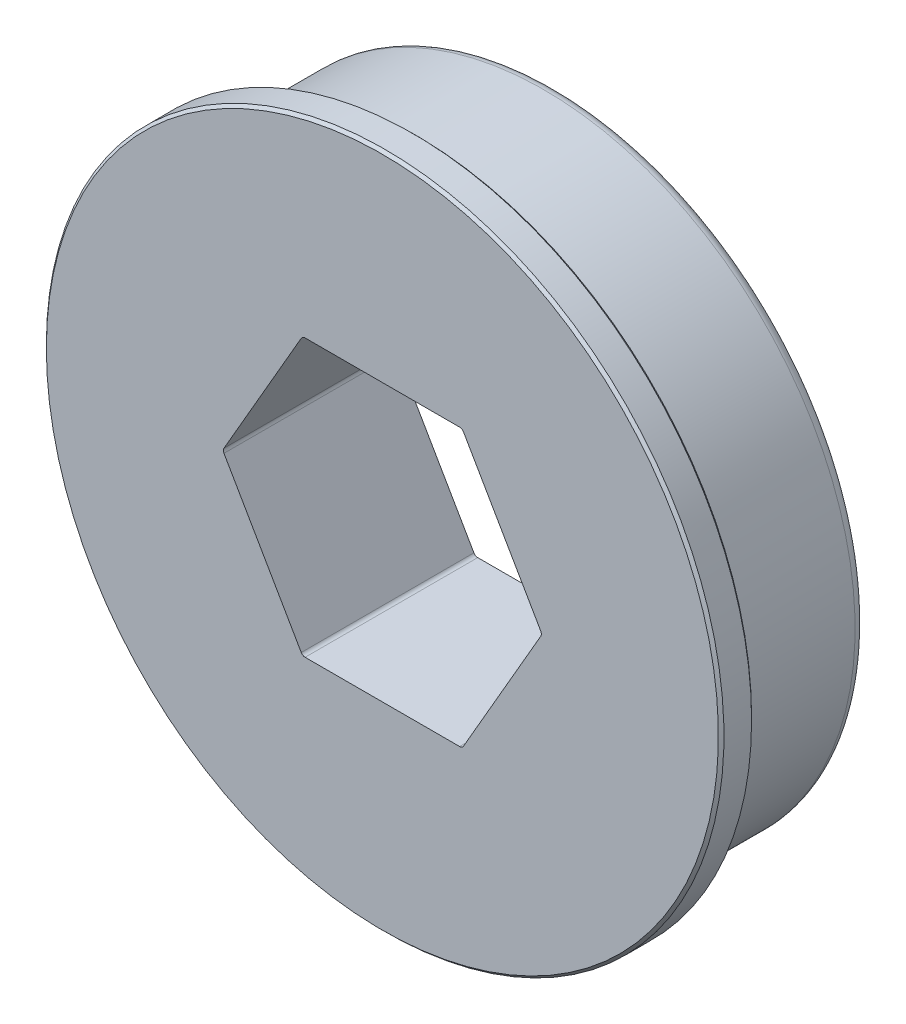
ISO-10303-21;
HEADER;
FILE_DESCRIPTION(('STEP AP214'),'2;1');
FILE_NAME('part.step','',(''),(''),'','','');
FILE_SCHEMA(('AUTOMOTIVE_DESIGN { 1 0 10303 214 1 1 1 1 }'));
ENDSEC;
DATA;
#1=APPLICATION_CONTEXT('core data for automotive mechanical design processes');
#2=APPLICATION_PROTOCOL_DEFINITION('international standard','automotive_design',2000,#1);
#3=PRODUCT_CONTEXT('',#1,'mechanical');
#4=PRODUCT('Part','Part','',(#3));
#5=PRODUCT_RELATED_PRODUCT_CATEGORY('part','',(#4));
#6=PRODUCT_DEFINITION_FORMATION('','',#4);
#7=PRODUCT_DEFINITION_CONTEXT('part definition',#1,'design');
#8=PRODUCT_DEFINITION('design','',#6,#7);
#9=PRODUCT_DEFINITION_SHAPE('','',#8);
#10=(LENGTH_UNIT() NAMED_UNIT(*) SI_UNIT(.MILLI.,.METRE.));
#11=(NAMED_UNIT(*) PLANE_ANGLE_UNIT() SI_UNIT($,.RADIAN.));
#12=(NAMED_UNIT(*) SI_UNIT($,.STERADIAN.) SOLID_ANGLE_UNIT());
#13=UNCERTAINTY_MEASURE_WITH_UNIT(LENGTH_MEASURE(1.E-05),#10,'distance_accuracy_value','');
#14=(GEOMETRIC_REPRESENTATION_CONTEXT(3) GLOBAL_UNCERTAINTY_ASSIGNED_CONTEXT((#13)) GLOBAL_UNIT_ASSIGNED_CONTEXT((#10,
#11,#12)) REPRESENTATION_CONTEXT('',''));
#15=CARTESIAN_POINT('',(0.,0.,0.));
#16=DIRECTION('',(0.,0.,1.));
#17=DIRECTION('',(1.,0.,0.));
#18=AXIS2_PLACEMENT_3D('',#15,#16,#17);
#19=CARTESIAN_POINT('',(0.,0.,7.92734));
#20=DIRECTION('',(0.,0.,-1.));
#21=DIRECTION('',(-1.,0.,0.));
#22=AXIS2_PLACEMENT_3D('',#19,#20,#21);
#23=CYLINDRICAL_SURFACE('',#22,13.97);
#24=CARTESIAN_POINT('',(0.,0.,6.40333999999999));
#25=DIRECTION('',(0.,0.,-1.));
#26=DIRECTION('',(-1.,0.,0.));
#27=AXIS2_PLACEMENT_3D('',#24,#25,#26);
#28=CIRCLE('',#27,13.97);
#29=CARTESIAN_POINT('',(-13.97,0.,6.40333999999999));
#30=VERTEX_POINT('',#29);
#31=EDGE_CURVE('E254',#30,#30,#28,.F.);
#32=ORIENTED_EDGE('',*,*,#31,.F.);
#33=EDGE_LOOP('',(#32));
#34=FACE_BOUND('',#33,.T.);
#35=CARTESIAN_POINT('',(0.,0.,5.89534));
#36=DIRECTION('',(0.,0.,-1.));
#37=DIRECTION('',(-1.,0.,0.));
#38=AXIS2_PLACEMENT_3D('',#35,#36,#37);
#39=CIRCLE('',#38,13.97);
#40=CARTESIAN_POINT('',(-13.97,0.,5.89534));
#41=VERTEX_POINT('',#40);
#42=EDGE_CURVE('E257',#41,#41,#39,.T.);
#43=ORIENTED_EDGE('',*,*,#42,.F.);
#44=EDGE_LOOP('',(#43));
#45=FACE_BOUND('',#44,.T.);
#46=ADVANCED_FACE('F16',(#34,#45),#23,.T.);
#47=CARTESIAN_POINT('',(14.2875,0.,5.89534));
#48=DIRECTION('',(0.,0.,1.));
#49=DIRECTION('',(1.,0.,0.));
#50=AXIS2_PLACEMENT_3D('',#47,#48,#49);
#51=PLANE('',#50);
#52=CARTESIAN_POINT('',(0.,0.,5.89534));
#53=DIRECTION('',(0.,0.,-1.));
#54=DIRECTION('',(-1.,0.,0.));
#55=AXIS2_PLACEMENT_3D('',#52,#53,#54);
#56=CIRCLE('',#55,14.2875);
#57=CARTESIAN_POINT('',(-14.2875,0.,5.89534));
#58=VERTEX_POINT('',#57);
#59=EDGE_CURVE('E251',#58,#58,#56,.T.);
#60=ORIENTED_EDGE('',*,*,#59,.F.);
#61=EDGE_LOOP('',(#60));
#62=FACE_BOUND('',#61,.T.);
#63=ORIENTED_EDGE('',*,*,#42,.T.);
#64=EDGE_LOOP('',(#63));
#65=FACE_BOUND('',#64,.T.);
#66=ADVANCED_FACE('F374',(#62,#65),#51,.T.);
#67=CARTESIAN_POINT('',(13.97,0.,6.40334));
#68=DIRECTION('',(0.,0.,-1.));
#69=DIRECTION('',(-1.,0.,0.));
#70=AXIS2_PLACEMENT_3D('',#67,#68,#69);
#71=PLANE('',#70);
#72=ORIENTED_EDGE('',*,*,#31,.T.);
#73=EDGE_LOOP('',(#72));
#74=FACE_BOUND('',#73,.T.);
#75=CARTESIAN_POINT('',(0.,0.,6.40334));
#76=DIRECTION('',(0.,0.,1.));
#77=DIRECTION('',(1.,0.,0.));
#78=AXIS2_PLACEMENT_3D('',#75,#76,#77);
#79=CIRCLE('',#78,15.4305);
#80=CARTESIAN_POINT('',(15.4305,0.,6.40334));
#81=VERTEX_POINT('',#80);
#82=EDGE_CURVE('E222',#81,#81,#79,.T.);
#83=ORIENTED_EDGE('',*,*,#82,.F.);
#84=EDGE_LOOP('',(#83));
#85=FACE_BOUND('',#84,.T.);
#86=ADVANCED_FACE('F372',(#74,#85),#71,.T.);
#87=CARTESIAN_POINT('',(0.,0.,7.92734));
#88=DIRECTION('',(0.,0.,-1.));
#89=DIRECTION('',(-1.,0.,0.));
#90=AXIS2_PLACEMENT_3D('',#87,#88,#89);
#91=CYLINDRICAL_SURFACE('',#90,14.2875);
#92=ORIENTED_EDGE('',*,*,#59,.T.);
#93=EDGE_LOOP('',(#92));
#94=FACE_BOUND('',#93,.T.);
#95=CARTESIAN_POINT('',(0.,0.,0.508));
#96=DIRECTION('',(0.,0.,-1.));
#97=DIRECTION('',(-1.,0.,0.));
#98=AXIS2_PLACEMENT_3D('',#95,#96,#97);
#99=CIRCLE('',#98,14.2875);
#100=CARTESIAN_POINT('',(-14.2875,0.,0.508));
#101=VERTEX_POINT('',#100);
#102=EDGE_CURVE('E219',#101,#101,#99,.T.);
#103=ORIENTED_EDGE('',*,*,#102,.F.);
#104=EDGE_LOOP('',(#103));
#105=FACE_BOUND('',#104,.T.);
#106=ADVANCED_FACE('F369',(#94,#105),#91,.T.);
#107=CARTESIAN_POINT('',(0.,0.,6.53034000000001));
#108=DIRECTION('',(0.,0.,1.));
#109=DIRECTION('',(1.,0.,0.));
#110=AXIS2_PLACEMENT_3D('',#107,#108,#109);
#111=CONICAL_SURFACE('',#110,15.5575,0.785398163397465);
#112=CARTESIAN_POINT('',(0.,0.,6.53034000000001));
#113=DIRECTION('',(0.,0.,-1.));
#114=DIRECTION('',(-1.,0.,0.));
#115=AXIS2_PLACEMENT_3D('',#112,#113,#114);
#116=CIRCLE('',#115,15.5575);
#117=CARTESIAN_POINT('',(-15.5575,0.,6.53034000000001));
#118=VERTEX_POINT('',#117);
#119=EDGE_CURVE('E83',#118,#118,#116,.F.);
#120=ORIENTED_EDGE('',*,*,#119,.F.);
#121=EDGE_LOOP('',(#120));
#122=FACE_BOUND('',#121,.T.);
#123=ORIENTED_EDGE('',*,*,#82,.T.);
#124=EDGE_LOOP('',(#123));
#125=FACE_BOUND('',#124,.T.);
#126=ADVANCED_FACE('F204',(#122,#125),#111,.T.);
#127=CARTESIAN_POINT('',(0.,0.,0.508));
#128=DIRECTION('',(0.,0.,-1.));
#129=DIRECTION('',(-1.,0.,0.));
#130=AXIS2_PLACEMENT_3D('',#127,#128,#129);
#131=TOROIDAL_SURFACE('',#130,13.7795,0.508);
#132=ORIENTED_EDGE('',*,*,#102,.T.);
#133=EDGE_LOOP('',(#132));
#134=FACE_BOUND('',#133,.T.);
#135=CARTESIAN_POINT('',(0.,0.,0.));
#136=DIRECTION('',(0.,0.,1.));
#137=DIRECTION('',(-1.,0.,0.));
#138=AXIS2_PLACEMENT_3D('',#135,#136,#137);
#139=CIRCLE('',#138,13.7795);
#140=CARTESIAN_POINT('',(13.7795,0.,0.));
#141=VERTEX_POINT('',#140);
#142=CARTESIAN_POINT('',(-13.7795,0.,0.));
#143=VERTEX_POINT('',#142);
#144=EDGE_CURVE('E242',#141,#143,#139,.F.);
#145=ORIENTED_EDGE('',*,*,#144,.F.);
#146=CARTESIAN_POINT('',(0.,0.,0.));
#147=DIRECTION('',(0.,0.,1.));
#148=DIRECTION('',(1.,0.,0.));
#149=AXIS2_PLACEMENT_3D('',#146,#147,#148);
#150=CIRCLE('',#149,13.7795);
#151=EDGE_CURVE('E152',#143,#141,#150,.F.);
#152=ORIENTED_EDGE('',*,*,#151,.F.);
#153=EDGE_LOOP('',(#145,#152));
#154=FACE_BOUND('',#153,.T.);
#155=ADVANCED_FACE('F198',(#134,#154),#131,.T.);
#156=CARTESIAN_POINT('',(0.,0.,7.92734));
#157=DIRECTION('',(0.,0.,-1.));
#158=DIRECTION('',(-1.,0.,0.));
#159=AXIS2_PLACEMENT_3D('',#156,#157,#158);
#160=CYLINDRICAL_SURFACE('',#159,15.5575);
#161=ORIENTED_EDGE('',*,*,#119,.T.);
#162=EDGE_LOOP('',(#161));
#163=FACE_BOUND('',#162,.T.);
#164=CARTESIAN_POINT('',(0.,0.,7.80034));
#165=DIRECTION('',(0.,0.,-1.));
#166=DIRECTION('',(-1.,0.,0.));
#167=AXIS2_PLACEMENT_3D('',#164,#165,#166);
#168=CIRCLE('',#167,15.5575);
#169=CARTESIAN_POINT('',(-15.5575,0.,7.80034));
#170=VERTEX_POINT('',#169);
#171=EDGE_CURVE('E143',#170,#170,#168,.F.);
#172=ORIENTED_EDGE('',*,*,#171,.F.);
#173=EDGE_LOOP('',(#172));
#174=FACE_BOUND('',#173,.T.);
#175=ADVANCED_FACE('F203',(#163,#174),#160,.T.);
#176=CARTESIAN_POINT('',(-7.09771326930958,0.,7.92734));
#177=DIRECTION('',(0.,0.,1.));
#178=DIRECTION('',(1.,0.,0.));
#179=AXIS2_PLACEMENT_3D('',#176,#177,#178);
#180=CYLINDRICAL_SURFACE('',#179,0.2032);
#181=DIRECTION('',(0.,0.,1.));
#182=VECTOR('',#181,1.);
#183=CARTESIAN_POINT('',(-7.27368963135858,-0.101600000000005,7.92734));
#184=LINE('',#183,#182);
#185=CARTESIAN_POINT('',(-7.27368963135857,-0.101600000000006,7.92734));
#186=VERTEX_POINT('',#185);
#187=CARTESIAN_POINT('',(-7.27368963135857,-0.101600000000005,0.));
#188=VERTEX_POINT('',#187);
#189=EDGE_CURVE('E141',#186,#188,#184,.F.);
#190=ORIENTED_EDGE('',*,*,#189,.T.);
#191=CARTESIAN_POINT('',(-7.09771326930958,0.,0.));
#192=DIRECTION('',(0.,0.,1.));
#193=DIRECTION('',(1.,0.,0.));
#194=AXIS2_PLACEMENT_3D('',#191,#192,#193);
#195=CIRCLE('',#194,0.2032);
#196=CARTESIAN_POINT('',(-7.27368963135857,0.101599999999994,0.));
#197=VERTEX_POINT('',#196);
#198=EDGE_CURVE('E91',#197,#188,#195,.T.);
#199=ORIENTED_EDGE('',*,*,#198,.F.);
#200=DIRECTION('',(0.,0.,1.));
#201=VECTOR('',#200,1.);
#202=CARTESIAN_POINT('',(-7.27368963135857,0.101599999999993,7.92734));
#203=LINE('',#202,#201);
#204=CARTESIAN_POINT('',(-7.27368963135857,0.101599999999994,7.92734));
#205=VERTEX_POINT('',#204);
#206=EDGE_CURVE('E87',#197,#205,#203,.T.);
#207=ORIENTED_EDGE('',*,*,#206,.T.);
#208=CARTESIAN_POINT('',(-7.09771326930958,0.,7.92734));
#209=DIRECTION('',(0.,0.,1.));
#210=DIRECTION('',(1.,0.,0.));
#211=AXIS2_PLACEMENT_3D('',#208,#209,#210);
#212=CIRCLE('',#211,0.2032);
#213=EDGE_CURVE('E71',#186,#205,#212,.F.);
#214=ORIENTED_EDGE('',*,*,#213,.F.);
#215=EDGE_LOOP('',(#190,#199,#207,#214));
#216=FACE_BOUND('',#215,.T.);
#217=ADVANCED_FACE('F88',(#216),#180,.F.);
#218=CARTESIAN_POINT('',(-3.54885663465479,6.14679999999999,7.92734));
#219=DIRECTION('',(0.,0.,1.));
#220=DIRECTION('',(1.,0.,0.));
#221=AXIS2_PLACEMENT_3D('',#218,#219,#220);
#222=CYLINDRICAL_SURFACE('',#221,0.2032);
#223=DIRECTION('',(0.,0.,1.));
#224=VECTOR('',#223,1.);
#225=CARTESIAN_POINT('',(-3.72483299670379,6.24839999999999,7.92734));
#226=LINE('',#225,#224);
#227=CARTESIAN_POINT('',(-3.72483299670379,6.24839999999999,7.92734));
#228=VERTEX_POINT('',#227);
#229=CARTESIAN_POINT('',(-3.72483299670378,6.24839999999999,0.));
#230=VERTEX_POINT('',#229);
#231=EDGE_CURVE('E101',#228,#230,#226,.F.);
#232=ORIENTED_EDGE('',*,*,#231,.T.);
#233=CARTESIAN_POINT('',(-3.54885663465479,6.14679999999999,0.));
#234=DIRECTION('',(0.,0.,1.));
#235=DIRECTION('',(1.,0.,0.));
#236=AXIS2_PLACEMENT_3D('',#233,#234,#235);
#237=CIRCLE('',#236,0.2032);
#238=CARTESIAN_POINT('',(-3.54885663465479,6.34999999999999,0.));
#239=VERTEX_POINT('',#238);
#240=EDGE_CURVE('E229',#239,#230,#237,.T.);
#241=ORIENTED_EDGE('',*,*,#240,.F.);
#242=DIRECTION('',(0.,0.,1.));
#243=VECTOR('',#242,1.);
#244=CARTESIAN_POINT('',(-3.54885663465479,6.34999999999999,7.92734));
#245=LINE('',#244,#243);
#246=CARTESIAN_POINT('',(-3.54885663465479,6.34999999999999,7.92734));
#247=VERTEX_POINT('',#246);
#248=EDGE_CURVE('E95',#239,#247,#245,.T.);
#249=ORIENTED_EDGE('',*,*,#248,.T.);
#250=CARTESIAN_POINT('',(-3.54885663465479,6.14679999999999,7.92734));
#251=DIRECTION('',(0.,0.,1.));
#252=DIRECTION('',(1.,0.,0.));
#253=AXIS2_PLACEMENT_3D('',#250,#251,#252);
#254=CIRCLE('',#253,0.2032);
#255=EDGE_CURVE('E82',#228,#247,#254,.F.);
#256=ORIENTED_EDGE('',*,*,#255,.F.);
#257=EDGE_LOOP('',(#232,#241,#249,#256));
#258=FACE_BOUND('',#257,.T.);
#259=ADVANCED_FACE('F319',(#258),#222,.F.);
#260=CARTESIAN_POINT('',(3.5488566346548,6.1468,7.92734));
#261=DIRECTION('',(0.,0.,1.));
#262=DIRECTION('',(1.,0.,0.));
#263=AXIS2_PLACEMENT_3D('',#260,#261,#262);
#264=CYLINDRICAL_SURFACE('',#263,0.2032);
#265=DIRECTION('',(0.,0.,1.));
#266=VECTOR('',#265,1.);
#267=CARTESIAN_POINT('',(3.5488566346548,6.35,7.92734));
#268=LINE('',#267,#266);
#269=CARTESIAN_POINT('',(3.5488566346548,6.34999999999999,7.92734));
#270=VERTEX_POINT('',#269);
#271=CARTESIAN_POINT('',(3.5488566346548,6.35,0.));
#272=VERTEX_POINT('',#271);
#273=EDGE_CURVE('E134',#270,#272,#268,.F.);
#274=ORIENTED_EDGE('',*,*,#273,.T.);
#275=CARTESIAN_POINT('',(3.5488566346548,6.1468,0.));
#276=DIRECTION('',(0.,0.,1.));
#277=DIRECTION('',(1.,0.,0.));
#278=AXIS2_PLACEMENT_3D('',#275,#276,#277);
#279=CIRCLE('',#278,0.2032);
#280=CARTESIAN_POINT('',(3.7248329967038,6.2484,0.));
#281=VERTEX_POINT('',#280);
#282=EDGE_CURVE('E232',#281,#272,#279,.T.);
#283=ORIENTED_EDGE('',*,*,#282,.F.);
#284=DIRECTION('',(0.,0.,1.));
#285=VECTOR('',#284,1.);
#286=CARTESIAN_POINT('',(3.72483299670379,6.2484,7.92734));
#287=LINE('',#286,#285);
#288=CARTESIAN_POINT('',(3.72483299670379,6.2484,7.92734));
#289=VERTEX_POINT('',#288);
#290=EDGE_CURVE('E124',#281,#289,#287,.T.);
#291=ORIENTED_EDGE('',*,*,#290,.T.);
#292=CARTESIAN_POINT('',(3.5488566346548,6.1468,7.92734));
#293=DIRECTION('',(0.,0.,1.));
#294=DIRECTION('',(1.,0.,0.));
#295=AXIS2_PLACEMENT_3D('',#292,#293,#294);
#296=CIRCLE('',#295,0.2032);
#297=EDGE_CURVE('E246',#270,#289,#296,.F.);
#298=ORIENTED_EDGE('',*,*,#297,.F.);
#299=EDGE_LOOP('',(#274,#283,#291,#298));
#300=FACE_BOUND('',#299,.T.);
#301=ADVANCED_FACE('F325',(#300),#264,.F.);
#302=CARTESIAN_POINT('',(7.09771326930959,0.,7.92734));
#303=DIRECTION('',(0.,0.,1.));
#304=DIRECTION('',(1.,0.,0.));
#305=AXIS2_PLACEMENT_3D('',#302,#303,#304);
#306=CYLINDRICAL_SURFACE('',#305,0.2032);
#307=CARTESIAN_POINT('',(7.09771326930959,0.,0.));
#308=DIRECTION('',(0.,0.,1.));
#309=DIRECTION('',(1.,0.,0.));
#310=AXIS2_PLACEMENT_3D('',#307,#308,#309);
#311=CIRCLE('',#310,0.2032);
#312=CARTESIAN_POINT('',(7.27368963135859,-0.101600000000005,0.));
#313=VERTEX_POINT('',#312);
#314=CARTESIAN_POINT('',(7.27368963135859,0.101599999999995,0.));
#315=VERTEX_POINT('',#314);
#316=EDGE_CURVE('E235',#313,#315,#311,.T.);
#317=ORIENTED_EDGE('',*,*,#316,.F.);
#318=DIRECTION('',(0.,0.,1.));
#319=VECTOR('',#318,1.);
#320=CARTESIAN_POINT('',(7.27368963135859,-0.101600000000005,7.92734));
#321=LINE('',#320,#319);
#322=CARTESIAN_POINT('',(7.27368963135859,-0.101600000000005,7.92734));
#323=VERTEX_POINT('',#322);
#324=EDGE_CURVE('E117',#313,#323,#321,.T.);
#325=ORIENTED_EDGE('',*,*,#324,.T.);
#326=CARTESIAN_POINT('',(7.09771326930959,0.,7.92734));
#327=DIRECTION('',(0.,0.,1.));
#328=DIRECTION('',(1.,0.,0.));
#329=AXIS2_PLACEMENT_3D('',#326,#327,#328);
#330=CIRCLE('',#329,0.2032);
#331=CARTESIAN_POINT('',(7.27368963135859,0.101599999999995,7.92734));
#332=VERTEX_POINT('',#331);
#333=EDGE_CURVE('E244',#332,#323,#330,.F.);
#334=ORIENTED_EDGE('',*,*,#333,.F.);
#335=DIRECTION('',(0.,0.,1.));
#336=VECTOR('',#335,1.);
#337=CARTESIAN_POINT('',(7.27368963135859,0.101599999999995,7.92734));
#338=LINE('',#337,#336);
#339=EDGE_CURVE('E128',#332,#315,#338,.F.);
#340=ORIENTED_EDGE('',*,*,#339,.T.);
#341=EDGE_LOOP('',(#317,#325,#334,#340));
#342=FACE_BOUND('',#341,.T.);
#343=ADVANCED_FACE('F306',(#342),#306,.F.);
#344=CARTESIAN_POINT('',(-3.54885663465478,-6.14680000000001,7.92734));
#345=DIRECTION('',(0.,0.,1.));
#346=DIRECTION('',(1.,0.,0.));
#347=AXIS2_PLACEMENT_3D('',#344,#345,#346);
#348=CYLINDRICAL_SURFACE('',#347,0.2032);
#349=DIRECTION('',(0.,0.,-1.));
#350=VECTOR('',#349,1.);
#351=CARTESIAN_POINT('',(-3.54885663465478,-6.35000000000001,7.92734));
#352=LINE('',#351,#350);
#353=CARTESIAN_POINT('',(-3.54885663465478,-6.35000000000001,7.92734));
#354=VERTEX_POINT('',#353);
#355=CARTESIAN_POINT('',(-3.54885663465478,-6.35000000000001,0.));
#356=VERTEX_POINT('',#355);
#357=EDGE_CURVE('E115',#354,#356,#352,.T.);
#358=ORIENTED_EDGE('',*,*,#357,.T.);
#359=CARTESIAN_POINT('',(-3.54885663465478,-6.14680000000001,0.));
#360=DIRECTION('',(0.,0.,1.));
#361=DIRECTION('',(1.,0.,0.));
#362=AXIS2_PLACEMENT_3D('',#359,#360,#361);
#363=CIRCLE('',#362,0.2032);
#364=CARTESIAN_POINT('',(-3.72483299670378,-6.24840000000001,0.));
#365=VERTEX_POINT('',#364);
#366=EDGE_CURVE('E238',#365,#356,#363,.T.);
#367=ORIENTED_EDGE('',*,*,#366,.F.);
#368=DIRECTION('',(0.,0.,1.));
#369=VECTOR('',#368,1.);
#370=CARTESIAN_POINT('',(-3.72483299670378,-6.24840000000001,7.92734));
#371=LINE('',#370,#369);
#372=CARTESIAN_POINT('',(-3.72483299670378,-6.24840000000001,7.92734));
#373=VERTEX_POINT('',#372);
#374=EDGE_CURVE('E138',#365,#373,#371,.T.);
#375=ORIENTED_EDGE('',*,*,#374,.T.);
#376=CARTESIAN_POINT('',(-3.54885663465478,-6.14680000000001,7.92734));
#377=DIRECTION('',(0.,0.,1.));
#378=DIRECTION('',(1.,0.,0.));
#379=AXIS2_PLACEMENT_3D('',#376,#377,#378);
#380=CIRCLE('',#379,0.2032);
#381=EDGE_CURVE('E36',#354,#373,#380,.F.);
#382=ORIENTED_EDGE('',*,*,#381,.F.);
#383=EDGE_LOOP('',(#358,#367,#375,#382));
#384=FACE_BOUND('',#383,.T.);
#385=ADVANCED_FACE('F169',(#384),#348,.F.);
#386=CARTESIAN_POINT('',(0.,0.,0.));
#387=DIRECTION('',(0.,0.,-1.));
#388=DIRECTION('',(-1.,0.,0.));
#389=AXIS2_PLACEMENT_3D('',#386,#387,#388);
#390=PLANE('',#389);
#391=DIRECTION('',(-1.,0.,0.));
#392=VECTOR('',#391,1.);
#393=CARTESIAN_POINT('',(-3.66617420935412,6.34999999999999,0.));
#394=LINE('',#393,#392);
#395=EDGE_CURVE('E131',#272,#239,#394,.T.);
#396=ORIENTED_EDGE('',*,*,#395,.T.);
#397=ORIENTED_EDGE('',*,*,#240,.T.);
#398=DIRECTION('',(-0.5,-0.866025403784439,0.));
#399=VECTOR('',#398,1.);
#400=CARTESIAN_POINT('',(-7.33234841870824,0.,0.));
#401=LINE('',#400,#399);
#402=EDGE_CURVE('E96',#230,#197,#401,.T.);
#403=ORIENTED_EDGE('',*,*,#402,.T.);
#404=ORIENTED_EDGE('',*,*,#198,.T.);
#405=DIRECTION('',(0.5,-0.866025403784439,0.));
#406=VECTOR('',#405,1.);
#407=CARTESIAN_POINT('',(-3.66617420935411,-6.35000000000001,0.));
#408=LINE('',#407,#406);
#409=EDGE_CURVE('E140',#188,#365,#408,.T.);
#410=ORIENTED_EDGE('',*,*,#409,.T.);
#411=ORIENTED_EDGE('',*,*,#366,.T.);
#412=DIRECTION('',(1.,0.,0.));
#413=VECTOR('',#412,1.);
#414=CARTESIAN_POINT('',(3.66617420935413,-6.35000000000001,0.));
#415=LINE('',#414,#413);
#416=CARTESIAN_POINT('',(3.5488566346548,-6.35000000000001,0.));
#417=VERTEX_POINT('',#416);
#418=EDGE_CURVE('E114',#356,#417,#415,.T.);
#419=ORIENTED_EDGE('',*,*,#418,.T.);
#420=CARTESIAN_POINT('',(3.5488566346548,-6.14680000000001,0.));
#421=DIRECTION('',(0.,0.,1.));
#422=DIRECTION('',(1.,0.,0.));
#423=AXIS2_PLACEMENT_3D('',#420,#421,#422);
#424=CIRCLE('',#423,0.2032);
#425=CARTESIAN_POINT('',(3.7248329967038,-6.24840000000001,0.));
#426=VERTEX_POINT('',#425);
#427=EDGE_CURVE('E226',#417,#426,#424,.T.);
#428=ORIENTED_EDGE('',*,*,#427,.T.);
#429=DIRECTION('',(0.5,0.866025403784439,0.));
#430=VECTOR('',#429,1.);
#431=CARTESIAN_POINT('',(7.33234841870825,0.,0.));
#432=LINE('',#431,#430);
#433=EDGE_CURVE('E120',#426,#313,#432,.T.);
#434=ORIENTED_EDGE('',*,*,#433,.T.);
#435=ORIENTED_EDGE('',*,*,#316,.T.);
#436=DIRECTION('',(-0.5,0.866025403784439,0.));
#437=VECTOR('',#436,1.);
#438=CARTESIAN_POINT('',(3.66617420935413,6.35,0.));
#439=LINE('',#438,#437);
#440=EDGE_CURVE('E127',#315,#281,#439,.T.);
#441=ORIENTED_EDGE('',*,*,#440,.T.);
#442=ORIENTED_EDGE('',*,*,#282,.T.);
#443=EDGE_LOOP('',(#396,#397,#403,#404,#410,#411,#419,#428,#434,#435,#441,#442));
#444=FACE_BOUND('',#443,.T.);
#445=ORIENTED_EDGE('',*,*,#151,.T.);
#446=ORIENTED_EDGE('',*,*,#144,.T.);
#447=EDGE_LOOP('',(#445,#446));
#448=FACE_BOUND('',#447,.T.);
#449=ADVANCED_FACE('F158',(#444,#448),#390,.T.);
#450=CARTESIAN_POINT('',(3.5488566346548,-6.14680000000001,7.92734));
#451=DIRECTION('',(0.,0.,1.));
#452=DIRECTION('',(1.,0.,0.));
#453=AXIS2_PLACEMENT_3D('',#450,#451,#452);
#454=CYLINDRICAL_SURFACE('',#453,0.2032);
#455=DIRECTION('',(0.,0.,1.));
#456=VECTOR('',#455,1.);
#457=CARTESIAN_POINT('',(3.7248329967038,-6.2484,7.92734));
#458=LINE('',#457,#456);
#459=CARTESIAN_POINT('',(3.7248329967038,-6.2484,7.92734));
#460=VERTEX_POINT('',#459);
#461=EDGE_CURVE('E121',#460,#426,#458,.F.);
#462=ORIENTED_EDGE('',*,*,#461,.T.);
#463=ORIENTED_EDGE('',*,*,#427,.F.);
#464=DIRECTION('',(0.,0.,-1.));
#465=VECTOR('',#464,1.);
#466=CARTESIAN_POINT('',(3.5488566346548,-6.35000000000001,7.92734));
#467=LINE('',#466,#465);
#468=CARTESIAN_POINT('',(3.5488566346548,-6.35000000000001,7.92734));
#469=VERTEX_POINT('',#468);
#470=EDGE_CURVE('E111',#417,#469,#467,.F.);
#471=ORIENTED_EDGE('',*,*,#470,.T.);
#472=CARTESIAN_POINT('',(3.5488566346548,-6.14680000000001,7.92734));
#473=DIRECTION('',(0.,0.,1.));
#474=DIRECTION('',(1.,0.,0.));
#475=AXIS2_PLACEMENT_3D('',#472,#473,#474);
#476=CIRCLE('',#475,0.2032);
#477=EDGE_CURVE('E193',#460,#469,#476,.F.);
#478=ORIENTED_EDGE('',*,*,#477,.F.);
#479=EDGE_LOOP('',(#462,#463,#471,#478));
#480=FACE_BOUND('',#479,.T.);
#481=ADVANCED_FACE('F168',(#480),#454,.F.);
#482=CARTESIAN_POINT('',(0.,0.,7.80034));
#483=DIRECTION('',(0.,0.,-1.));
#484=DIRECTION('',(-1.,0.,0.));
#485=AXIS2_PLACEMENT_3D('',#482,#483,#484);
#486=CONICAL_SURFACE('',#485,15.5575,0.785398163397442);
#487=ORIENTED_EDGE('',*,*,#171,.T.);
#488=EDGE_LOOP('',(#487));
#489=FACE_BOUND('',#488,.T.);
#490=CARTESIAN_POINT('',(0.,0.,7.92734));
#491=DIRECTION('',(0.,0.,-1.));
#492=DIRECTION('',(-1.,0.,0.));
#493=AXIS2_PLACEMENT_3D('',#490,#491,#492);
#494=CIRCLE('',#493,15.4305);
#495=CARTESIAN_POINT('',(-15.4305,0.,7.92734));
#496=VERTEX_POINT('',#495);
#497=EDGE_CURVE('E107',#496,#496,#494,.F.);
#498=ORIENTED_EDGE('',*,*,#497,.F.);
#499=EDGE_LOOP('',(#498));
#500=FACE_BOUND('',#499,.T.);
#501=ADVANCED_FACE('F350',(#489,#500),#486,.T.);
#502=CARTESIAN_POINT('',(-3.66617420935411,-6.35000000000001,7.92734));
#503=DIRECTION('',(-0.866025403784439,-0.5,0.));
#504=DIRECTION('',(0.5,-0.866025403784439,0.));
#505=AXIS2_PLACEMENT_3D('',#502,#503,#504);
#506=PLANE('',#505);
#507=ORIENTED_EDGE('',*,*,#374,.F.);
#508=ORIENTED_EDGE('',*,*,#409,.F.);
#509=ORIENTED_EDGE('',*,*,#189,.F.);
#510=DIRECTION('',(-0.5,0.866025403784438,0.));
#511=VECTOR('',#510,1.);
#512=CARTESIAN_POINT('',(-3.72483299670378,-6.24840000000001,7.92734));
#513=LINE('',#512,#511);
#514=EDGE_CURVE('E81',#373,#186,#513,.T.);
#515=ORIENTED_EDGE('',*,*,#514,.F.);
#516=EDGE_LOOP('',(#507,#508,#509,#515));
#517=FACE_BOUND('',#516,.T.);
#518=ADVANCED_FACE('F315',(#517),#506,.F.);
#519=CARTESIAN_POINT('',(-7.33234841870824,0.,7.92734));
#520=DIRECTION('',(-0.866025403784439,0.5,0.));
#521=DIRECTION('',(-0.5,-0.866025403784439,0.));
#522=AXIS2_PLACEMENT_3D('',#519,#520,#521);
#523=PLANE('',#522);
#524=ORIENTED_EDGE('',*,*,#206,.F.);
#525=ORIENTED_EDGE('',*,*,#402,.F.);
#526=ORIENTED_EDGE('',*,*,#231,.F.);
#527=DIRECTION('',(0.5,0.866025403784439,0.));
#528=VECTOR('',#527,1.);
#529=CARTESIAN_POINT('',(-7.27368963135857,0.101599999999993,7.92734));
#530=LINE('',#529,#528);
#531=EDGE_CURVE('E79',#205,#228,#530,.T.);
#532=ORIENTED_EDGE('',*,*,#531,.F.);
#533=EDGE_LOOP('',(#524,#525,#526,#532));
#534=FACE_BOUND('',#533,.T.);
#535=ADVANCED_FACE('F99',(#534),#523,.F.);
#536=CARTESIAN_POINT('',(-3.66617420935412,6.34999999999999,7.92734));
#537=DIRECTION('',(0.,1.,0.));
#538=DIRECTION('',(-1.,0.,0.));
#539=AXIS2_PLACEMENT_3D('',#536,#537,#538);
#540=PLANE('',#539);
#541=ORIENTED_EDGE('',*,*,#273,.F.);
#542=DIRECTION('',(1.,0.,0.));
#543=VECTOR('',#542,1.);
#544=CARTESIAN_POINT('',(15.5575,6.34999999999999,7.92734));
#545=LINE('',#544,#543);
#546=EDGE_CURVE('E102',#247,#270,#545,.T.);
#547=ORIENTED_EDGE('',*,*,#546,.F.);
#548=ORIENTED_EDGE('',*,*,#248,.F.);
#549=ORIENTED_EDGE('',*,*,#395,.F.);
#550=EDGE_LOOP('',(#541,#547,#548,#549));
#551=FACE_BOUND('',#550,.T.);
#552=ADVANCED_FACE('F323',(#551),#540,.F.);
#553=CARTESIAN_POINT('',(3.66617420935413,6.35,7.92734));
#554=DIRECTION('',(0.866025403784439,0.5,0.));
#555=DIRECTION('',(-0.5,0.866025403784439,0.));
#556=AXIS2_PLACEMENT_3D('',#553,#554,#555);
#557=PLANE('',#556);
#558=ORIENTED_EDGE('',*,*,#290,.F.);
#559=ORIENTED_EDGE('',*,*,#440,.F.);
#560=ORIENTED_EDGE('',*,*,#339,.F.);
#561=DIRECTION('',(0.5,-0.866025403784438,0.));
#562=VECTOR('',#561,1.);
#563=CARTESIAN_POINT('',(3.72483299670379,6.2484,7.92734));
#564=LINE('',#563,#562);
#565=EDGE_CURVE('E105',#289,#332,#564,.T.);
#566=ORIENTED_EDGE('',*,*,#565,.F.);
#567=EDGE_LOOP('',(#558,#559,#560,#566));
#568=FACE_BOUND('',#567,.T.);
#569=ADVANCED_FACE('F312',(#568),#557,.F.);
#570=CARTESIAN_POINT('',(7.33234841870825,0.,7.92734));
#571=DIRECTION('',(0.866025403784439,-0.5,0.));
#572=DIRECTION('',(0.5,0.866025403784439,0.));
#573=AXIS2_PLACEMENT_3D('',#570,#571,#572);
#574=PLANE('',#573);
#575=ORIENTED_EDGE('',*,*,#324,.F.);
#576=ORIENTED_EDGE('',*,*,#433,.F.);
#577=ORIENTED_EDGE('',*,*,#461,.F.);
#578=DIRECTION('',(-0.5,-0.866025403784439,0.));
#579=VECTOR('',#578,1.);
#580=CARTESIAN_POINT('',(7.27368963135859,-0.101600000000005,7.92734));
#581=LINE('',#580,#579);
#582=EDGE_CURVE('E27',#323,#460,#581,.T.);
#583=ORIENTED_EDGE('',*,*,#582,.F.);
#584=EDGE_LOOP('',(#575,#576,#577,#583));
#585=FACE_BOUND('',#584,.T.);
#586=ADVANCED_FACE('F303',(#585),#574,.F.);
#587=CARTESIAN_POINT('',(3.66617420935413,-6.35000000000001,7.92734));
#588=DIRECTION('',(0.,-1.,0.));
#589=DIRECTION('',(0.,0.,-1.));
#590=AXIS2_PLACEMENT_3D('',#587,#588,#589);
#591=PLANE('',#590);
#592=ORIENTED_EDGE('',*,*,#470,.F.);
#593=ORIENTED_EDGE('',*,*,#418,.F.);
#594=ORIENTED_EDGE('',*,*,#357,.F.);
#595=DIRECTION('',(1.,0.,0.));
#596=VECTOR('',#595,1.);
#597=CARTESIAN_POINT('',(15.5575,-6.35000000000001,7.92734));
#598=LINE('',#597,#596);
#599=EDGE_CURVE('E11',#469,#354,#598,.F.);
#600=ORIENTED_EDGE('',*,*,#599,.F.);
#601=EDGE_LOOP('',(#592,#593,#594,#600));
#602=FACE_BOUND('',#601,.T.);
#603=ADVANCED_FACE('F295',(#602),#591,.F.);
#604=CARTESIAN_POINT('',(15.5575,0.,7.92734));
#605=DIRECTION('',(0.,0.,1.));
#606=DIRECTION('',(1.,0.,0.));
#607=AXIS2_PLACEMENT_3D('',#604,#605,#606);
#608=PLANE('',#607);
#609=ORIENTED_EDGE('',*,*,#599,.T.);
#610=ORIENTED_EDGE('',*,*,#381,.T.);
#611=ORIENTED_EDGE('',*,*,#514,.T.);
#612=ORIENTED_EDGE('',*,*,#213,.T.);
#613=ORIENTED_EDGE('',*,*,#531,.T.);
#614=ORIENTED_EDGE('',*,*,#255,.T.);
#615=ORIENTED_EDGE('',*,*,#546,.T.);
#616=ORIENTED_EDGE('',*,*,#297,.T.);
#617=ORIENTED_EDGE('',*,*,#565,.T.);
#618=ORIENTED_EDGE('',*,*,#333,.T.);
#619=ORIENTED_EDGE('',*,*,#582,.T.);
#620=ORIENTED_EDGE('',*,*,#477,.T.);
#621=EDGE_LOOP('',(#609,#610,#611,#612,#613,#614,#615,#616,#617,#618,#619,#620));
#622=FACE_BOUND('',#621,.T.);
#623=ORIENTED_EDGE('',*,*,#497,.T.);
#624=EDGE_LOOP('',(#623));
#625=FACE_BOUND('',#624,.T.);
#626=ADVANCED_FACE('F76',(#622,#625),#608,.T.);
#627=CLOSED_SHELL('',(#46,#66,#86,#106,#126,#155,#175,#217,#259,#301,#343,#385,#449,#481,#501,
#518,#535,#552,#569,#586,#603,#626));
#628=MANIFOLD_SOLID_BREP('B1',#627);
#629=ADVANCED_BREP_SHAPE_REPRESENTATION('',(#18,#628),#14);
#630=SHAPE_DEFINITION_REPRESENTATION(#9,#629);
ENDSEC;
END-ISO-10303-21;
